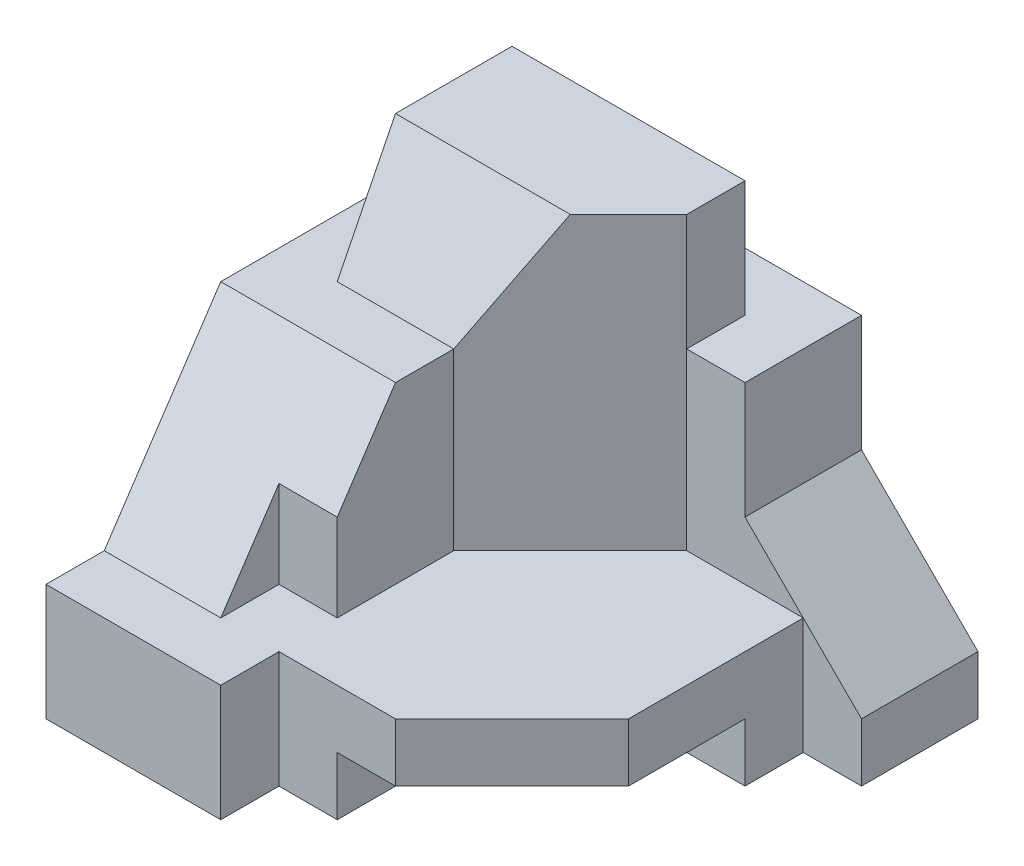
ISO-10303-21;
HEADER;
FILE_DESCRIPTION(('STEP AP214'),'2;1');
FILE_NAME('part.step','',(''),(''),'','','');
FILE_SCHEMA(('AUTOMOTIVE_DESIGN { 1 0 10303 214 1 1 1 1 }'));
ENDSEC;
DATA;
#1=APPLICATION_CONTEXT('core data for automotive mechanical design processes');
#2=APPLICATION_PROTOCOL_DEFINITION('international standard','automotive_design',2000,#1);
#3=PRODUCT_CONTEXT('',#1,'mechanical');
#4=PRODUCT('Part','Part','',(#3));
#5=PRODUCT_RELATED_PRODUCT_CATEGORY('part','',(#4));
#6=PRODUCT_DEFINITION_FORMATION('','',#4);
#7=PRODUCT_DEFINITION_CONTEXT('part definition',#1,'design');
#8=PRODUCT_DEFINITION('design','',#6,#7);
#9=PRODUCT_DEFINITION_SHAPE('','',#8);
#10=(LENGTH_UNIT() NAMED_UNIT(*) SI_UNIT(.MILLI.,.METRE.));
#11=(NAMED_UNIT(*) PLANE_ANGLE_UNIT() SI_UNIT($,.RADIAN.));
#12=(NAMED_UNIT(*) SI_UNIT($,.STERADIAN.) SOLID_ANGLE_UNIT());
#13=UNCERTAINTY_MEASURE_WITH_UNIT(LENGTH_MEASURE(1.E-05),#10,'distance_accuracy_value','');
#14=(GEOMETRIC_REPRESENTATION_CONTEXT(3) GLOBAL_UNCERTAINTY_ASSIGNED_CONTEXT((#13)) GLOBAL_UNIT_ASSIGNED_CONTEXT((#10,
#11,#12)) REPRESENTATION_CONTEXT('',''));
#15=CARTESIAN_POINT('',(0.,0.,0.));
#16=DIRECTION('',(0.,0.,1.));
#17=DIRECTION('',(1.,0.,0.));
#18=AXIS2_PLACEMENT_3D('',#15,#16,#17);
#19=CARTESIAN_POINT('',(-4.,-3.5,8.));
#20=DIRECTION('',(1.,0.,0.));
#21=DIRECTION('',(0.,0.,-1.));
#22=AXIS2_PLACEMENT_3D('',#19,#20,#21);
#23=PLANE('',#22);
#24=DIRECTION('',(0.,0.,1.));
#25=VECTOR('',#24,1.);
#26=CARTESIAN_POINT('',(-4.,1.5,8.));
#27=LINE('',#26,#25);
#28=CARTESIAN_POINT('',(-4.,1.5,0.));
#29=VERTEX_POINT('',#28);
#30=CARTESIAN_POINT('',(-4.,1.5,5.));
#31=VERTEX_POINT('',#30);
#32=EDGE_CURVE('E312',#29,#31,#27,.T.);
#33=ORIENTED_EDGE('',*,*,#32,.F.);
#34=DIRECTION('',(0.,-1.,0.));
#35=VECTOR('',#34,1.);
#36=CARTESIAN_POINT('',(-4.,-3.5,0.));
#37=LINE('',#36,#35);
#38=CARTESIAN_POINT('',(-4.,-3.5,0.));
#39=VERTEX_POINT('',#38);
#40=EDGE_CURVE('E255',#29,#39,#37,.T.);
#41=ORIENTED_EDGE('',*,*,#40,.T.);
#42=DIRECTION('',(0.,0.,-1.));
#43=VECTOR('',#42,1.);
#44=CARTESIAN_POINT('',(-4.,-3.5,8.));
#45=LINE('',#44,#43);
#46=CARTESIAN_POINT('',(-4.,-3.5,8.));
#47=VERTEX_POINT('',#46);
#48=EDGE_CURVE('E264',#47,#39,#45,.T.);
#49=ORIENTED_EDGE('',*,*,#48,.F.);
#50=DIRECTION('',(0.,-1.,0.));
#51=VECTOR('',#50,1.);
#52=CARTESIAN_POINT('',(-4.,-3.5,8.));
#53=LINE('',#52,#51);
#54=CARTESIAN_POINT('',(-4.,-1.5,8.));
#55=VERTEX_POINT('',#54);
#56=EDGE_CURVE('E248',#55,#47,#53,.T.);
#57=ORIENTED_EDGE('',*,*,#56,.F.);
#58=DIRECTION('',(0.,0.,1.));
#59=VECTOR('',#58,1.);
#60=CARTESIAN_POINT('',(-4.,-1.5,8.));
#61=LINE('',#60,#59);
#62=CARTESIAN_POINT('',(-4.,-1.5,7.));
#63=VERTEX_POINT('',#62);
#64=EDGE_CURVE('E322',#63,#55,#61,.T.);
#65=ORIENTED_EDGE('',*,*,#64,.F.);
#66=DIRECTION('',(0.,-0.832050294337844,0.554700196225229));
#67=VECTOR('',#66,1.);
#68=CARTESIAN_POINT('',(-4.,-1.5,7.));
#69=LINE('',#68,#67);
#70=EDGE_CURVE('E320',#31,#63,#69,.T.);
#71=ORIENTED_EDGE('',*,*,#70,.F.);
#72=EDGE_LOOP('',(#33,#41,#49,#57,#65,#71));
#73=FACE_BOUND('',#72,.T.);
#74=ADVANCED_FACE('F34',(#73),#23,.F.);
#75=CARTESIAN_POINT('',(0.,0.,0.));
#76=DIRECTION('',(0.,0.,1.));
#77=DIRECTION('',(1.,0.,0.));
#78=AXIS2_PLACEMENT_3D('',#75,#76,#77);
#79=PLANE('',#78);
#80=DIRECTION('',(-1.,0.,0.));
#81=VECTOR('',#80,1.);
#82=CARTESIAN_POINT('',(0.,1.5,0.));
#83=LINE('',#82,#81);
#84=CARTESIAN_POINT('',(2.,1.5,0.));
#85=VERTEX_POINT('',#84);
#86=EDGE_CURVE('E316',#85,#29,#83,.T.);
#87=ORIENTED_EDGE('',*,*,#86,.F.);
#88=DIRECTION('',(0.,1.,0.));
#89=VECTOR('',#88,1.);
#90=CARTESIAN_POINT('',(2.,-0.5,0.));
#91=LINE('',#90,#89);
#92=CARTESIAN_POINT('',(2.,-0.5,0.));
#93=VERTEX_POINT('',#92);
#94=EDGE_CURVE('E335',#93,#85,#91,.T.);
#95=ORIENTED_EDGE('',*,*,#94,.F.);
#96=DIRECTION('',(-0.707106781186548,0.707106781186548,0.));
#97=VECTOR('',#96,1.);
#98=CARTESIAN_POINT('',(2.,-0.5,0.));
#99=LINE('',#98,#97);
#100=CARTESIAN_POINT('',(4.,-2.5,0.));
#101=VERTEX_POINT('',#100);
#102=EDGE_CURVE('E334',#101,#93,#99,.T.);
#103=ORIENTED_EDGE('',*,*,#102,.F.);
#104=DIRECTION('',(0.,1.,0.));
#105=VECTOR('',#104,1.);
#106=CARTESIAN_POINT('',(4.,-3.5,0.));
#107=LINE('',#106,#105);
#108=CARTESIAN_POINT('',(4.,-3.5,0.));
#109=VERTEX_POINT('',#108);
#110=EDGE_CURVE('E251',#109,#101,#107,.T.);
#111=ORIENTED_EDGE('',*,*,#110,.F.);
#112=DIRECTION('',(1.,0.,0.));
#113=VECTOR('',#112,1.);
#114=CARTESIAN_POINT('',(4.,-3.5,0.));
#115=LINE('',#114,#113);
#116=EDGE_CURVE('E257',#39,#109,#115,.T.);
#117=ORIENTED_EDGE('',*,*,#116,.F.);
#118=ORIENTED_EDGE('',*,*,#40,.F.);
#119=EDGE_LOOP('',(#87,#95,#103,#111,#117,#118));
#120=FACE_BOUND('',#119,.T.);
#121=ADVANCED_FACE('F440',(#120),#79,.F.);
#122=CARTESIAN_POINT('',(3.,-3.5,2.));
#123=DIRECTION('',(-1.,0.,0.));
#124=DIRECTION('',(0.,0.,1.));
#125=AXIS2_PLACEMENT_3D('',#122,#123,#124);
#126=PLANE('',#125);
#127=DIRECTION('',(0.,1.,0.));
#128=VECTOR('',#127,1.);
#129=CARTESIAN_POINT('',(3.,-3.5,2.));
#130=LINE('',#129,#128);
#131=CARTESIAN_POINT('',(3.,-3.5,2.));
#132=VERTEX_POINT('',#131);
#133=CARTESIAN_POINT('',(3.,-1.5,2.));
#134=VERTEX_POINT('',#133);
#135=EDGE_CURVE('E230',#132,#134,#130,.T.);
#136=ORIENTED_EDGE('',*,*,#135,.T.);
#137=DIRECTION('',(0.,0.,-1.));
#138=VECTOR('',#137,1.);
#139=CARTESIAN_POINT('',(3.,-1.5,4.));
#140=LINE('',#139,#138);
#141=CARTESIAN_POINT('',(3.,-1.5,5.));
#142=VERTEX_POINT('',#141);
#143=EDGE_CURVE('E193',#142,#134,#140,.T.);
#144=ORIENTED_EDGE('',*,*,#143,.F.);
#145=DIRECTION('',(0.,1.,0.));
#146=VECTOR('',#145,1.);
#147=CARTESIAN_POINT('',(3.,-3.5,5.));
#148=LINE('',#147,#146);
#149=CARTESIAN_POINT('',(3.,-2.5,5.));
#150=VERTEX_POINT('',#149);
#151=EDGE_CURVE('E240',#150,#142,#148,.T.);
#152=ORIENTED_EDGE('',*,*,#151,.F.);
#153=DIRECTION('',(0.,0.,1.));
#154=VECTOR('',#153,1.);
#155=CARTESIAN_POINT('',(3.,-2.5,5.));
#156=LINE('',#155,#154);
#157=CARTESIAN_POINT('',(3.,-2.5,3.));
#158=VERTEX_POINT('',#157);
#159=EDGE_CURVE('E352',#158,#150,#156,.T.);
#160=ORIENTED_EDGE('',*,*,#159,.F.);
#161=DIRECTION('',(0.,-1.,0.));
#162=VECTOR('',#161,1.);
#163=CARTESIAN_POINT('',(3.,-2.5,3.));
#164=LINE('',#163,#162);
#165=CARTESIAN_POINT('',(3.,-3.5,3.));
#166=VERTEX_POINT('',#165);
#167=EDGE_CURVE('E360',#158,#166,#164,.T.);
#168=ORIENTED_EDGE('',*,*,#167,.T.);
#169=DIRECTION('',(0.,0.,1.));
#170=VECTOR('',#169,1.);
#171=CARTESIAN_POINT('',(3.,-3.5,2.));
#172=LINE('',#171,#170);
#173=EDGE_CURVE('E238',#132,#166,#172,.T.);
#174=ORIENTED_EDGE('',*,*,#173,.F.);
#175=EDGE_LOOP('',(#136,#144,#152,#160,#168,#174));
#176=FACE_BOUND('',#175,.T.);
#177=ADVANCED_FACE('F235',(#176),#126,.F.);
#178=CARTESIAN_POINT('',(2.,-0.5,2.));
#179=DIRECTION('',(-1.,0.,0.));
#180=DIRECTION('',(0.,0.,1.));
#181=AXIS2_PLACEMENT_3D('',#178,#179,#180);
#182=PLANE('',#181);
#183=DIRECTION('',(0.,0.,-1.));
#184=VECTOR('',#183,1.);
#185=CARTESIAN_POINT('',(2.,1.5,2.));
#186=LINE('',#185,#184);
#187=CARTESIAN_POINT('',(2.,1.5,2.));
#188=VERTEX_POINT('',#187);
#189=EDGE_CURVE('E318',#188,#85,#186,.T.);
#190=ORIENTED_EDGE('',*,*,#189,.F.);
#191=DIRECTION('',(0.,1.,0.));
#192=VECTOR('',#191,1.);
#193=CARTESIAN_POINT('',(2.,1.5,2.));
#194=LINE('',#193,#192);
#195=CARTESIAN_POINT('',(2.,-0.5,2.));
#196=VERTEX_POINT('',#195);
#197=EDGE_CURVE('E225',#196,#188,#194,.T.);
#198=ORIENTED_EDGE('',*,*,#197,.F.);
#199=DIRECTION('',(0.,0.,-1.));
#200=VECTOR('',#199,1.);
#201=CARTESIAN_POINT('',(2.,-0.5,2.));
#202=LINE('',#201,#200);
#203=EDGE_CURVE('E224',#196,#93,#202,.T.);
#204=ORIENTED_EDGE('',*,*,#203,.T.);
#205=ORIENTED_EDGE('',*,*,#94,.T.);
#206=EDGE_LOOP('',(#190,#198,#204,#205));
#207=FACE_BOUND('',#206,.T.);
#208=ADVANCED_FACE('F444',(#207),#182,.F.);
#209=CARTESIAN_POINT('',(4.,-3.5,8.));
#210=DIRECTION('',(0.,1.,0.));
#211=DIRECTION('',(-1.,0.,0.));
#212=AXIS2_PLACEMENT_3D('',#209,#210,#211);
#213=PLANE('',#212);
#214=ORIENTED_EDGE('',*,*,#173,.T.);
#215=DIRECTION('',(1.,0.,0.));
#216=VECTOR('',#215,1.);
#217=CARTESIAN_POINT('',(3.,-3.5,3.));
#218=LINE('',#217,#216);
#219=CARTESIAN_POINT('',(0.,-3.5,3.));
#220=VERTEX_POINT('',#219);
#221=EDGE_CURVE('E347',#220,#166,#218,.T.);
#222=ORIENTED_EDGE('',*,*,#221,.F.);
#223=DIRECTION('',(0.,0.,-1.));
#224=VECTOR('',#223,1.);
#225=CARTESIAN_POINT('',(0.,-3.5,3.));
#226=LINE('',#225,#224);
#227=CARTESIAN_POINT('',(0.,-3.5,7.));
#228=VERTEX_POINT('',#227);
#229=EDGE_CURVE('E341',#228,#220,#226,.T.);
#230=ORIENTED_EDGE('',*,*,#229,.F.);
#231=DIRECTION('',(-1.,0.,0.));
#232=VECTOR('',#231,1.);
#233=CARTESIAN_POINT('',(1.,-3.5,7.));
#234=LINE('',#233,#232);
#235=CARTESIAN_POINT('',(-1.,-3.5,7.));
#236=VERTEX_POINT('',#235);
#237=EDGE_CURVE('E368',#228,#236,#234,.T.);
#238=ORIENTED_EDGE('',*,*,#237,.T.);
#239=DIRECTION('',(0.,0.,1.));
#240=VECTOR('',#239,1.);
#241=CARTESIAN_POINT('',(-1.,-3.5,7.));
#242=LINE('',#241,#240);
#243=CARTESIAN_POINT('',(-1.,-3.5,8.));
#244=VERTEX_POINT('',#243);
#245=EDGE_CURVE('E244',#236,#244,#242,.T.);
#246=ORIENTED_EDGE('',*,*,#245,.T.);
#247=DIRECTION('',(1.,0.,0.));
#248=VECTOR('',#247,1.);
#249=CARTESIAN_POINT('',(4.,-3.5,8.));
#250=LINE('',#249,#248);
#251=EDGE_CURVE('E250',#47,#244,#250,.T.);
#252=ORIENTED_EDGE('',*,*,#251,.F.);
#253=ORIENTED_EDGE('',*,*,#48,.T.);
#254=ORIENTED_EDGE('',*,*,#116,.T.);
#255=DIRECTION('',(0.,0.,-1.));
#256=VECTOR('',#255,1.);
#257=CARTESIAN_POINT('',(4.,-3.5,8.));
#258=LINE('',#257,#256);
#259=CARTESIAN_POINT('',(4.,-3.5,2.));
#260=VERTEX_POINT('',#259);
#261=EDGE_CURVE('E254',#260,#109,#258,.T.);
#262=ORIENTED_EDGE('',*,*,#261,.F.);
#263=DIRECTION('',(-1.,0.,0.));
#264=VECTOR('',#263,1.);
#265=CARTESIAN_POINT('',(4.,-3.5,2.));
#266=LINE('',#265,#264);
#267=EDGE_CURVE('E362',#260,#132,#266,.T.);
#268=ORIENTED_EDGE('',*,*,#267,.T.);
#269=EDGE_LOOP('',(#214,#222,#230,#238,#246,#252,#253,#254,#262,#268));
#270=FACE_BOUND('',#269,.T.);
#271=ADVANCED_FACE('F421',(#270),#213,.F.);
#272=CARTESIAN_POINT('',(4.,-3.5,8.));
#273=DIRECTION('',(-1.,0.,0.));
#274=DIRECTION('',(0.,0.,1.));
#275=AXIS2_PLACEMENT_3D('',#272,#273,#274);
#276=PLANE('',#275);
#277=ORIENTED_EDGE('',*,*,#110,.T.);
#278=DIRECTION('',(0.,0.,-1.));
#279=VECTOR('',#278,1.);
#280=CARTESIAN_POINT('',(4.,-2.5,2.));
#281=LINE('',#280,#279);
#282=CARTESIAN_POINT('',(4.,-2.5,2.));
#283=VERTEX_POINT('',#282);
#284=EDGE_CURVE('E234',#283,#101,#281,.T.);
#285=ORIENTED_EDGE('',*,*,#284,.F.);
#286=DIRECTION('',(0.,1.,0.));
#287=VECTOR('',#286,1.);
#288=CARTESIAN_POINT('',(4.,-3.5,2.));
#289=LINE('',#288,#287);
#290=EDGE_CURVE('E233',#260,#283,#289,.T.);
#291=ORIENTED_EDGE('',*,*,#290,.F.);
#292=ORIENTED_EDGE('',*,*,#261,.T.);
#293=EDGE_LOOP('',(#277,#285,#291,#292));
#294=FACE_BOUND('',#293,.T.);
#295=ADVANCED_FACE('F435',(#294),#276,.F.);
#296=CARTESIAN_POINT('',(0.,0.,8.));
#297=DIRECTION('',(0.,0.,1.));
#298=DIRECTION('',(1.,0.,0.));
#299=AXIS2_PLACEMENT_3D('',#296,#297,#298);
#300=PLANE('',#299);
#301=DIRECTION('',(-1.,0.,0.));
#302=VECTOR('',#301,1.);
#303=CARTESIAN_POINT('',(4.,-1.5,8.));
#304=LINE('',#303,#302);
#305=CARTESIAN_POINT('',(-1.,-1.5,8.));
#306=VERTEX_POINT('',#305);
#307=EDGE_CURVE('E325',#306,#55,#304,.T.);
#308=ORIENTED_EDGE('',*,*,#307,.T.);
#309=ORIENTED_EDGE('',*,*,#56,.T.);
#310=ORIENTED_EDGE('',*,*,#251,.T.);
#311=DIRECTION('',(0.,1.,0.));
#312=VECTOR('',#311,1.);
#313=CARTESIAN_POINT('',(-1.,-3.5,8.));
#314=LINE('',#313,#312);
#315=EDGE_CURVE('E258',#244,#306,#314,.T.);
#316=ORIENTED_EDGE('',*,*,#315,.T.);
#317=EDGE_LOOP('',(#308,#309,#310,#316));
#318=FACE_BOUND('',#317,.T.);
#319=ADVANCED_FACE('F415',(#318),#300,.T.);
#320=CARTESIAN_POINT('',(-1.,-3.5,7.));
#321=DIRECTION('',(-1.,0.,0.));
#322=DIRECTION('',(0.,0.,1.));
#323=AXIS2_PLACEMENT_3D('',#320,#321,#322);
#324=PLANE('',#323);
#325=DIRECTION('',(0.,1.,0.));
#326=VECTOR('',#325,1.);
#327=CARTESIAN_POINT('',(-1.,-3.5,7.));
#328=LINE('',#327,#326);
#329=CARTESIAN_POINT('',(-1.,-1.5,7.));
#330=VERTEX_POINT('',#329);
#331=EDGE_CURVE('E374',#236,#330,#328,.T.);
#332=ORIENTED_EDGE('',*,*,#331,.T.);
#333=DIRECTION('',(0.,0.,1.));
#334=VECTOR('',#333,1.);
#335=CARTESIAN_POINT('',(-1.,-1.5,7.));
#336=LINE('',#335,#334);
#337=EDGE_CURVE('E328',#330,#306,#336,.T.);
#338=ORIENTED_EDGE('',*,*,#337,.T.);
#339=ORIENTED_EDGE('',*,*,#315,.F.);
#340=ORIENTED_EDGE('',*,*,#245,.F.);
#341=EDGE_LOOP('',(#332,#338,#339,#340));
#342=FACE_BOUND('',#341,.T.);
#343=ADVANCED_FACE('F419',(#342),#324,.F.);
#344=CARTESIAN_POINT('',(1.,-3.5,7.));
#345=DIRECTION('',(0.,0.,-1.));
#346=DIRECTION('',(-1.,0.,0.));
#347=AXIS2_PLACEMENT_3D('',#344,#345,#346);
#348=PLANE('',#347);
#349=DIRECTION('',(0.,1.,0.));
#350=VECTOR('',#349,1.);
#351=CARTESIAN_POINT('',(1.,-3.5,7.));
#352=LINE('',#351,#350);
#353=CARTESIAN_POINT('',(1.,-2.5,7.));
#354=VERTEX_POINT('',#353);
#355=CARTESIAN_POINT('',(1.,-1.5,7.));
#356=VERTEX_POINT('',#355);
#357=EDGE_CURVE('E242',#354,#356,#352,.T.);
#358=ORIENTED_EDGE('',*,*,#357,.T.);
#359=DIRECTION('',(-1.,0.,0.));
#360=VECTOR('',#359,1.);
#361=CARTESIAN_POINT('',(4.,-1.5,7.));
#362=LINE('',#361,#360);
#363=EDGE_CURVE('E329',#356,#330,#362,.T.);
#364=ORIENTED_EDGE('',*,*,#363,.T.);
#365=ORIENTED_EDGE('',*,*,#331,.F.);
#366=ORIENTED_EDGE('',*,*,#237,.F.);
#367=DIRECTION('',(0.,-1.,0.));
#368=VECTOR('',#367,1.);
#369=CARTESIAN_POINT('',(0.,-2.5,7.));
#370=LINE('',#369,#368);
#371=CARTESIAN_POINT('',(0.,-2.5,7.));
#372=VERTEX_POINT('',#371);
#373=EDGE_CURVE('E356',#372,#228,#370,.T.);
#374=ORIENTED_EDGE('',*,*,#373,.F.);
#375=DIRECTION('',(-1.,0.,0.));
#376=VECTOR('',#375,1.);
#377=CARTESIAN_POINT('',(0.,-2.5,7.));
#378=LINE('',#377,#376);
#379=EDGE_CURVE('E343',#354,#372,#378,.T.);
#380=ORIENTED_EDGE('',*,*,#379,.F.);
#381=EDGE_LOOP('',(#358,#364,#365,#366,#374,#380));
#382=FACE_BOUND('',#381,.T.);
#383=ADVANCED_FACE('F381',(#382),#348,.F.);
#384=CARTESIAN_POINT('',(3.,-3.5,5.));
#385=DIRECTION('',(-0.707106781186547,0.,-0.707106781186548));
#386=DIRECTION('',(-0.707106781186548,0.,0.707106781186547));
#387=AXIS2_PLACEMENT_3D('',#384,#385,#386);
#388=PLANE('',#387);
#389=ORIENTED_EDGE('',*,*,#151,.T.);
#390=DIRECTION('',(-0.707106781186548,0.,0.707106781186547));
#391=VECTOR('',#390,1.);
#392=CARTESIAN_POINT('',(3.,-1.5,5.));
#393=LINE('',#392,#391);
#394=EDGE_CURVE('E200',#142,#356,#393,.T.);
#395=ORIENTED_EDGE('',*,*,#394,.T.);
#396=ORIENTED_EDGE('',*,*,#357,.F.);
#397=DIRECTION('',(-0.707106781186548,0.,0.707106781186547));
#398=VECTOR('',#397,1.);
#399=CARTESIAN_POINT('',(1.,-2.5,7.));
#400=LINE('',#399,#398);
#401=EDGE_CURVE('E354',#150,#354,#400,.T.);
#402=ORIENTED_EDGE('',*,*,#401,.F.);
#403=EDGE_LOOP('',(#389,#395,#396,#402));
#404=FACE_BOUND('',#403,.T.);
#405=ADVANCED_FACE('F386',(#404),#388,.F.);
#406=CARTESIAN_POINT('',(4.,-3.5,2.));
#407=DIRECTION('',(0.,0.,-1.));
#408=DIRECTION('',(-1.,0.,0.));
#409=AXIS2_PLACEMENT_3D('',#406,#407,#408);
#410=PLANE('',#409);
#411=ORIENTED_EDGE('',*,*,#290,.T.);
#412=DIRECTION('',(-0.707106781186548,0.707106781186548,0.));
#413=VECTOR('',#412,1.);
#414=CARTESIAN_POINT('',(2.,-0.5,2.));
#415=LINE('',#414,#413);
#416=EDGE_CURVE('E222',#283,#134,#415,.T.);
#417=ORIENTED_EDGE('',*,*,#416,.T.);
#418=ORIENTED_EDGE('',*,*,#135,.F.);
#419=ORIENTED_EDGE('',*,*,#267,.F.);
#420=EDGE_LOOP('',(#411,#417,#418,#419));
#421=FACE_BOUND('',#420,.T.);
#422=ADVANCED_FACE('F229',(#421),#410,.F.);
#423=CARTESIAN_POINT('',(3.,-2.5,3.));
#424=DIRECTION('',(0.,0.,-1.));
#425=DIRECTION('',(-1.,0.,0.));
#426=AXIS2_PLACEMENT_3D('',#423,#424,#425);
#427=PLANE('',#426);
#428=ORIENTED_EDGE('',*,*,#221,.T.);
#429=ORIENTED_EDGE('',*,*,#167,.F.);
#430=DIRECTION('',(1.,0.,0.));
#431=VECTOR('',#430,1.);
#432=CARTESIAN_POINT('',(3.,-2.5,3.));
#433=LINE('',#432,#431);
#434=CARTESIAN_POINT('',(0.,-2.5,3.));
#435=VERTEX_POINT('',#434);
#436=EDGE_CURVE('E350',#435,#158,#433,.T.);
#437=ORIENTED_EDGE('',*,*,#436,.F.);
#438=DIRECTION('',(0.,-1.,0.));
#439=VECTOR('',#438,1.);
#440=CARTESIAN_POINT('',(0.,-2.5,3.));
#441=LINE('',#440,#439);
#442=EDGE_CURVE('E363',#435,#220,#441,.T.);
#443=ORIENTED_EDGE('',*,*,#442,.T.);
#444=EDGE_LOOP('',(#428,#429,#437,#443));
#445=FACE_BOUND('',#444,.T.);
#446=ADVANCED_FACE('F515',(#445),#427,.F.);
#447=CARTESIAN_POINT('',(0.,-2.5,3.));
#448=DIRECTION('',(-1.,0.,0.));
#449=DIRECTION('',(0.,-1.,0.));
#450=AXIS2_PLACEMENT_3D('',#447,#448,#449);
#451=PLANE('',#450);
#452=ORIENTED_EDGE('',*,*,#229,.T.);
#453=ORIENTED_EDGE('',*,*,#442,.F.);
#454=DIRECTION('',(0.,0.,-1.));
#455=VECTOR('',#454,1.);
#456=CARTESIAN_POINT('',(0.,-2.5,3.));
#457=LINE('',#456,#455);
#458=EDGE_CURVE('E346',#372,#435,#457,.T.);
#459=ORIENTED_EDGE('',*,*,#458,.F.);
#460=ORIENTED_EDGE('',*,*,#373,.T.);
#461=EDGE_LOOP('',(#452,#453,#459,#460));
#462=FACE_BOUND('',#461,.T.);
#463=ADVANCED_FACE('F426',(#462),#451,.F.);
#464=CARTESIAN_POINT('',(0.,-2.5,0.));
#465=DIRECTION('',(0.,1.,0.));
#466=DIRECTION('',(0.,0.,1.));
#467=AXIS2_PLACEMENT_3D('',#464,#465,#466);
#468=PLANE('',#467);
#469=ORIENTED_EDGE('',*,*,#379,.T.);
#470=ORIENTED_EDGE('',*,*,#458,.T.);
#471=ORIENTED_EDGE('',*,*,#436,.T.);
#472=ORIENTED_EDGE('',*,*,#159,.T.);
#473=ORIENTED_EDGE('',*,*,#401,.T.);
#474=EDGE_LOOP('',(#469,#470,#471,#472,#473));
#475=FACE_BOUND('',#474,.T.);
#476=ADVANCED_FACE('F429',(#475),#468,.F.);
#477=CARTESIAN_POINT('',(2.,-0.5,2.));
#478=DIRECTION('',(-0.707106781186547,-0.707106781186547,0.));
#479=DIRECTION('',(0.707106781186548,-0.707106781186548,0.));
#480=AXIS2_PLACEMENT_3D('',#477,#478,#479);
#481=PLANE('',#480);
#482=ORIENTED_EDGE('',*,*,#102,.T.);
#483=ORIENTED_EDGE('',*,*,#203,.F.);
#484=EDGE_CURVE('E211',#134,#196,#415,.T.);
#485=ORIENTED_EDGE('',*,*,#484,.F.);
#486=ORIENTED_EDGE('',*,*,#416,.F.);
#487=ORIENTED_EDGE('',*,*,#284,.T.);
#488=EDGE_LOOP('',(#482,#483,#485,#486,#487));
#489=FACE_BOUND('',#488,.T.);
#490=ADVANCED_FACE('F221',(#489),#481,.F.);
#491=CARTESIAN_POINT('',(4.,-1.5,8.));
#492=DIRECTION('',(0.,-1.,0.));
#493=DIRECTION('',(0.,0.,-1.));
#494=AXIS2_PLACEMENT_3D('',#491,#492,#493);
#495=PLANE('',#494);
#496=ORIENTED_EDGE('',*,*,#337,.F.);
#497=ORIENTED_EDGE('',*,*,#363,.F.);
#498=ORIENTED_EDGE('',*,*,#394,.F.);
#499=ORIENTED_EDGE('',*,*,#143,.T.);
#500=DIRECTION('',(-1.,0.,0.));
#501=VECTOR('',#500,1.);
#502=CARTESIAN_POINT('',(1.,-1.5,2.));
#503=LINE('',#502,#501);
#504=CARTESIAN_POINT('',(1.,-1.5,2.));
#505=VERTEX_POINT('',#504);
#506=EDGE_CURVE('E197',#134,#505,#503,.T.);
#507=ORIENTED_EDGE('',*,*,#506,.T.);
#508=DIRECTION('',(-0.707106781186548,0.,0.707106781186547));
#509=VECTOR('',#508,1.);
#510=CARTESIAN_POINT('',(1.,-1.5,2.));
#511=LINE('',#510,#509);
#512=CARTESIAN_POINT('',(-1.,-1.5,4.));
#513=VERTEX_POINT('',#512);
#514=EDGE_CURVE('E449',#505,#513,#511,.T.);
#515=ORIENTED_EDGE('',*,*,#514,.T.);
#516=DIRECTION('',(0.,0.,1.));
#517=VECTOR('',#516,1.);
#518=CARTESIAN_POINT('',(-1.,-1.5,7.));
#519=LINE('',#518,#517);
#520=CARTESIAN_POINT('',(-1.,-1.5,6.));
#521=VERTEX_POINT('',#520);
#522=EDGE_CURVE('E206',#513,#521,#519,.T.);
#523=ORIENTED_EDGE('',*,*,#522,.T.);
#524=DIRECTION('',(-1.,0.,0.));
#525=VECTOR('',#524,1.);
#526=CARTESIAN_POINT('',(-1.,-1.5,6.));
#527=LINE('',#526,#525);
#528=CARTESIAN_POINT('',(-2.,-1.5,6.));
#529=VERTEX_POINT('',#528);
#530=EDGE_CURVE('E394',#521,#529,#527,.T.);
#531=ORIENTED_EDGE('',*,*,#530,.T.);
#532=DIRECTION('',(0.,0.,1.));
#533=VECTOR('',#532,1.);
#534=CARTESIAN_POINT('',(-2.,-1.5,6.));
#535=LINE('',#534,#533);
#536=CARTESIAN_POINT('',(-2.,-1.5,7.));
#537=VERTEX_POINT('',#536);
#538=EDGE_CURVE('E55',#529,#537,#535,.T.);
#539=ORIENTED_EDGE('',*,*,#538,.T.);
#540=EDGE_CURVE('E275',#537,#63,#362,.T.);
#541=ORIENTED_EDGE('',*,*,#540,.T.);
#542=ORIENTED_EDGE('',*,*,#64,.T.);
#543=ORIENTED_EDGE('',*,*,#307,.F.);
#544=EDGE_LOOP('',(#496,#497,#498,#499,#507,#515,#523,#531,#539,#541,#542,#543));
#545=FACE_BOUND('',#544,.T.);
#546=ADVANCED_FACE('F195',(#545),#495,.F.);
#547=CARTESIAN_POINT('',(4.,-1.5,7.));
#548=DIRECTION('',(0.,-0.554700196225229,-0.832050294337844));
#549=DIRECTION('',(0.,0.832050294337844,-0.554700196225229));
#550=AXIS2_PLACEMENT_3D('',#547,#548,#549);
#551=PLANE('',#550);
#552=DIRECTION('',(1.,0.,0.));
#553=VECTOR('',#552,1.);
#554=CARTESIAN_POINT('',(4.,0.,5.99999999999999));
#555=LINE('',#554,#553);
#556=CARTESIAN_POINT('',(-2.,0.,6.));
#557=VERTEX_POINT('',#556);
#558=CARTESIAN_POINT('',(-1.,0.,6.));
#559=VERTEX_POINT('',#558);
#560=EDGE_CURVE('E267',#557,#559,#555,.T.);
#561=ORIENTED_EDGE('',*,*,#560,.T.);
#562=DIRECTION('',(0.,0.832050294337844,-0.554700196225229));
#563=VECTOR('',#562,1.);
#564=CARTESIAN_POINT('',(-1.,-1.5,7.));
#565=LINE('',#564,#563);
#566=CARTESIAN_POINT('',(-1.,1.5,5.));
#567=VERTEX_POINT('',#566);
#568=EDGE_CURVE('E387',#559,#567,#565,.T.);
#569=ORIENTED_EDGE('',*,*,#568,.T.);
#570=DIRECTION('',(-1.,0.,0.));
#571=VECTOR('',#570,1.);
#572=CARTESIAN_POINT('',(4.,1.5,5.));
#573=LINE('',#572,#571);
#574=EDGE_CURVE('E324',#567,#31,#573,.T.);
#575=ORIENTED_EDGE('',*,*,#574,.T.);
#576=ORIENTED_EDGE('',*,*,#70,.T.);
#577=ORIENTED_EDGE('',*,*,#540,.F.);
#578=DIRECTION('',(0.,0.832050294337844,-0.554700196225229));
#579=VECTOR('',#578,1.);
#580=CARTESIAN_POINT('',(-2.,-1.5,7.));
#581=LINE('',#580,#579);
#582=EDGE_CURVE('E41',#537,#557,#581,.T.);
#583=ORIENTED_EDGE('',*,*,#582,.T.);
#584=EDGE_LOOP('',(#561,#569,#575,#576,#577,#583));
#585=FACE_BOUND('',#584,.T.);
#586=ADVANCED_FACE('F272',(#585),#551,.F.);
#587=CARTESIAN_POINT('',(0.,1.5,4.));
#588=DIRECTION('',(0.,1.,0.));
#589=DIRECTION('',(-1.,0.,0.));
#590=AXIS2_PLACEMENT_3D('',#587,#588,#589);
#591=PLANE('',#590);
#592=DIRECTION('',(-1.,0.,0.));
#593=VECTOR('',#592,1.);
#594=CARTESIAN_POINT('',(1.,1.5,2.));
#595=LINE('',#594,#593);
#596=CARTESIAN_POINT('',(1.,1.5,2.));
#597=VERTEX_POINT('',#596);
#598=EDGE_CURVE('E215',#188,#597,#595,.T.);
#599=ORIENTED_EDGE('',*,*,#598,.F.);
#600=ORIENTED_EDGE('',*,*,#189,.T.);
#601=ORIENTED_EDGE('',*,*,#86,.T.);
#602=ORIENTED_EDGE('',*,*,#32,.T.);
#603=ORIENTED_EDGE('',*,*,#574,.F.);
#604=DIRECTION('',(0.,0.,1.));
#605=VECTOR('',#604,1.);
#606=CARTESIAN_POINT('',(-1.,1.5,4.));
#607=LINE('',#606,#605);
#608=CARTESIAN_POINT('',(-1.,1.5,4.));
#609=VERTEX_POINT('',#608);
#610=EDGE_CURVE('E389',#609,#567,#607,.T.);
#611=ORIENTED_EDGE('',*,*,#610,.F.);
#612=DIRECTION('',(1.,0.,0.));
#613=VECTOR('',#612,1.);
#614=CARTESIAN_POINT('',(-3.,1.5,4.));
#615=LINE('',#614,#613);
#616=CARTESIAN_POINT('',(-3.,1.5,4.));
#617=VERTEX_POINT('',#616);
#618=EDGE_CURVE('E300',#617,#609,#615,.T.);
#619=ORIENTED_EDGE('',*,*,#618,.F.);
#620=DIRECTION('',(0.,0.,1.));
#621=VECTOR('',#620,1.);
#622=CARTESIAN_POINT('',(-3.,1.5,1.));
#623=LINE('',#622,#621);
#624=CARTESIAN_POINT('',(-3.,1.5,1.));
#625=VERTEX_POINT('',#624);
#626=EDGE_CURVE('E296',#625,#617,#623,.T.);
#627=ORIENTED_EDGE('',*,*,#626,.F.);
#628=DIRECTION('',(-1.,0.,0.));
#629=VECTOR('',#628,1.);
#630=CARTESIAN_POINT('',(1.,1.5,1.));
#631=LINE('',#630,#629);
#632=CARTESIAN_POINT('',(1.,1.5,1.));
#633=VERTEX_POINT('',#632);
#634=EDGE_CURVE('E293',#633,#625,#631,.T.);
#635=ORIENTED_EDGE('',*,*,#634,.F.);
#636=DIRECTION('',(0.,0.,-1.));
#637=VECTOR('',#636,1.);
#638=CARTESIAN_POINT('',(1.,1.5,4.));
#639=LINE('',#638,#637);
#640=EDGE_CURVE('E303',#597,#633,#639,.T.);
#641=ORIENTED_EDGE('',*,*,#640,.F.);
#642=EDGE_LOOP('',(#599,#600,#601,#602,#603,#611,#619,#627,#635,#641));
#643=FACE_BOUND('',#642,.T.);
#644=ADVANCED_FACE('F404',(#643),#591,.T.);
#645=CARTESIAN_POINT('',(1.,1.5,1.));
#646=DIRECTION('',(0.,0.,-1.));
#647=DIRECTION('',(-1.,0.,0.));
#648=AXIS2_PLACEMENT_3D('',#645,#646,#647);
#649=PLANE('',#648);
#650=DIRECTION('',(-1.,0.,0.));
#651=VECTOR('',#650,1.);
#652=CARTESIAN_POINT('',(1.,3.5,1.));
#653=LINE('',#652,#651);
#654=CARTESIAN_POINT('',(1.,3.5,1.));
#655=VERTEX_POINT('',#654);
#656=CARTESIAN_POINT('',(-3.,3.5,1.));
#657=VERTEX_POINT('',#656);
#658=EDGE_CURVE('E282',#655,#657,#653,.T.);
#659=ORIENTED_EDGE('',*,*,#658,.F.);
#660=DIRECTION('',(0.,1.,0.));
#661=VECTOR('',#660,1.);
#662=CARTESIAN_POINT('',(1.,1.5,1.));
#663=LINE('',#662,#661);
#664=EDGE_CURVE('E309',#633,#655,#663,.T.);
#665=ORIENTED_EDGE('',*,*,#664,.F.);
#666=ORIENTED_EDGE('',*,*,#634,.T.);
#667=DIRECTION('',(0.,1.,0.));
#668=VECTOR('',#667,1.);
#669=CARTESIAN_POINT('',(-3.,1.5,1.));
#670=LINE('',#669,#668);
#671=EDGE_CURVE('E304',#625,#657,#670,.T.);
#672=ORIENTED_EDGE('',*,*,#671,.T.);
#673=EDGE_LOOP('',(#659,#665,#666,#672));
#674=FACE_BOUND('',#673,.T.);
#675=ADVANCED_FACE('F472',(#674),#649,.T.);
#676=CARTESIAN_POINT('',(1.,1.5,4.));
#677=DIRECTION('',(1.,0.,0.));
#678=DIRECTION('',(0.,0.,-1.));
#679=AXIS2_PLACEMENT_3D('',#676,#677,#678);
#680=PLANE('',#679);
#681=DIRECTION('',(0.,1.,0.));
#682=VECTOR('',#681,1.);
#683=CARTESIAN_POINT('',(1.,-1.5,2.));
#684=LINE('',#683,#682);
#685=CARTESIAN_POINT('',(1.,3.5,2.));
#686=VERTEX_POINT('',#685);
#687=EDGE_CURVE('E451',#597,#686,#684,.T.);
#688=ORIENTED_EDGE('',*,*,#687,.F.);
#689=ORIENTED_EDGE('',*,*,#640,.T.);
#690=ORIENTED_EDGE('',*,*,#664,.T.);
#691=DIRECTION('',(0.,0.,-1.));
#692=VECTOR('',#691,1.);
#693=CARTESIAN_POINT('',(1.,3.5,4.));
#694=LINE('',#693,#692);
#695=EDGE_CURVE('E297',#686,#655,#694,.T.);
#696=ORIENTED_EDGE('',*,*,#695,.F.);
#697=EDGE_LOOP('',(#688,#689,#690,#696));
#698=FACE_BOUND('',#697,.T.);
#699=ADVANCED_FACE('F476',(#698),#680,.T.);
#700=CARTESIAN_POINT('',(-3.,1.5,1.));
#701=DIRECTION('',(-1.,0.,0.));
#702=DIRECTION('',(0.,-1.,0.));
#703=AXIS2_PLACEMENT_3D('',#700,#701,#702);
#704=PLANE('',#703);
#705=DIRECTION('',(0.,-0.894427190999916,0.447213595499958));
#706=VECTOR('',#705,1.);
#707=CARTESIAN_POINT('',(-3.,1.5,4.));
#708=LINE('',#707,#706);
#709=CARTESIAN_POINT('',(-3.,3.5,3.));
#710=VERTEX_POINT('',#709);
#711=EDGE_CURVE('E454',#710,#617,#708,.T.);
#712=ORIENTED_EDGE('',*,*,#711,.F.);
#713=DIRECTION('',(0.,0.,1.));
#714=VECTOR('',#713,1.);
#715=CARTESIAN_POINT('',(-3.,3.5,1.));
#716=LINE('',#715,#714);
#717=EDGE_CURVE('E286',#657,#710,#716,.T.);
#718=ORIENTED_EDGE('',*,*,#717,.F.);
#719=ORIENTED_EDGE('',*,*,#671,.F.);
#720=ORIENTED_EDGE('',*,*,#626,.T.);
#721=EDGE_LOOP('',(#712,#718,#719,#720));
#722=FACE_BOUND('',#721,.T.);
#723=ADVANCED_FACE('F465',(#722),#704,.T.);
#724=CARTESIAN_POINT('',(4.,3.5,8.));
#725=DIRECTION('',(0.,-1.,0.));
#726=DIRECTION('',(1.,0.,0.));
#727=AXIS2_PLACEMENT_3D('',#724,#725,#726);
#728=PLANE('',#727);
#729=DIRECTION('',(-1.,0.,0.));
#730=VECTOR('',#729,1.);
#731=CARTESIAN_POINT('',(-3.,3.5,3.));
#732=LINE('',#731,#730);
#733=CARTESIAN_POINT('',(0.,3.5,3.));
#734=VERTEX_POINT('',#733);
#735=EDGE_CURVE('E456',#734,#710,#732,.T.);
#736=ORIENTED_EDGE('',*,*,#735,.F.);
#737=DIRECTION('',(-0.707106781186548,0.,0.707106781186547));
#738=VECTOR('',#737,1.);
#739=CARTESIAN_POINT('',(1.,3.5,2.));
#740=LINE('',#739,#738);
#741=EDGE_CURVE('E48',#686,#734,#740,.T.);
#742=ORIENTED_EDGE('',*,*,#741,.F.);
#743=ORIENTED_EDGE('',*,*,#695,.T.);
#744=ORIENTED_EDGE('',*,*,#658,.T.);
#745=ORIENTED_EDGE('',*,*,#717,.T.);
#746=EDGE_LOOP('',(#736,#742,#743,#744,#745));
#747=FACE_BOUND('',#746,.T.);
#748=ADVANCED_FACE('F467',(#747),#728,.F.);
#749=CARTESIAN_POINT('',(-2.,-1.5,6.));
#750=DIRECTION('',(-1.,0.,0.));
#751=DIRECTION('',(0.,-1.,0.));
#752=AXIS2_PLACEMENT_3D('',#749,#750,#751);
#753=PLANE('',#752);
#754=ORIENTED_EDGE('',*,*,#538,.F.);
#755=DIRECTION('',(0.,1.,0.));
#756=VECTOR('',#755,1.);
#757=CARTESIAN_POINT('',(-2.,-1.5,6.));
#758=LINE('',#757,#756);
#759=EDGE_CURVE('E279',#529,#557,#758,.T.);
#760=ORIENTED_EDGE('',*,*,#759,.T.);
#761=ORIENTED_EDGE('',*,*,#582,.F.);
#762=EDGE_LOOP('',(#754,#760,#761));
#763=FACE_BOUND('',#762,.T.);
#764=ADVANCED_FACE('F278',(#763),#753,.F.);
#765=CARTESIAN_POINT('',(-1.,-1.5,6.));
#766=DIRECTION('',(0.,0.,-1.));
#767=DIRECTION('',(-1.,0.,0.));
#768=AXIS2_PLACEMENT_3D('',#765,#766,#767);
#769=PLANE('',#768);
#770=ORIENTED_EDGE('',*,*,#759,.F.);
#771=ORIENTED_EDGE('',*,*,#530,.F.);
#772=DIRECTION('',(0.,1.,0.));
#773=VECTOR('',#772,1.);
#774=CARTESIAN_POINT('',(-1.,-1.5,6.));
#775=LINE('',#774,#773);
#776=EDGE_CURVE('E283',#521,#559,#775,.T.);
#777=ORIENTED_EDGE('',*,*,#776,.T.);
#778=ORIENTED_EDGE('',*,*,#560,.F.);
#779=EDGE_LOOP('',(#770,#771,#777,#778));
#780=FACE_BOUND('',#779,.T.);
#781=ADVANCED_FACE('F397',(#780),#769,.F.);
#782=CARTESIAN_POINT('',(-1.,-1.5,6.));
#783=DIRECTION('',(-1.,0.,0.));
#784=DIRECTION('',(0.,0.,1.));
#785=AXIS2_PLACEMENT_3D('',#782,#783,#784);
#786=PLANE('',#785);
#787=ORIENTED_EDGE('',*,*,#610,.T.);
#788=ORIENTED_EDGE('',*,*,#568,.F.);
#789=ORIENTED_EDGE('',*,*,#776,.F.);
#790=ORIENTED_EDGE('',*,*,#522,.F.);
#791=DIRECTION('',(0.,1.,0.));
#792=VECTOR('',#791,1.);
#793=CARTESIAN_POINT('',(-1.,-1.5,4.));
#794=LINE('',#793,#792);
#795=EDGE_CURVE('E205',#513,#609,#794,.T.);
#796=ORIENTED_EDGE('',*,*,#795,.T.);
#797=EDGE_LOOP('',(#787,#788,#789,#790,#796));
#798=FACE_BOUND('',#797,.T.);
#799=ADVANCED_FACE('F399',(#798),#786,.F.);
#800=CARTESIAN_POINT('',(0.,1.9,3.8));
#801=DIRECTION('',(0.,-0.447213595499958,-0.894427190999916));
#802=DIRECTION('',(0.,0.894427190999916,-0.447213595499958));
#803=AXIS2_PLACEMENT_3D('',#800,#801,#802);
#804=PLANE('',#803);
#805=ORIENTED_EDGE('',*,*,#618,.T.);
#806=DIRECTION('',(0.408248290463863,0.816496580927726,-0.408248290463863));
#807=VECTOR('',#806,1.);
#808=CARTESIAN_POINT('',(-0.666666666666668,2.16666666666667,3.66666666666667));
#809=LINE('',#808,#807);
#810=EDGE_CURVE('E12',#609,#734,#809,.T.);
#811=ORIENTED_EDGE('',*,*,#810,.T.);
#812=ORIENTED_EDGE('',*,*,#735,.T.);
#813=ORIENTED_EDGE('',*,*,#711,.T.);
#814=EDGE_LOOP('',(#805,#811,#812,#813));
#815=FACE_BOUND('',#814,.T.);
#816=ADVANCED_FACE('F461',(#815),#804,.F.);
#817=CARTESIAN_POINT('',(1.,-1.5,2.));
#818=DIRECTION('',(-0.707106781186547,0.,-0.707106781186548));
#819=DIRECTION('',(-0.707106781186548,0.,0.707106781186547));
#820=AXIS2_PLACEMENT_3D('',#817,#818,#819);
#821=PLANE('',#820);
#822=ORIENTED_EDGE('',*,*,#795,.F.);
#823=ORIENTED_EDGE('',*,*,#514,.F.);
#824=EDGE_CURVE('E214',#505,#597,#684,.T.);
#825=ORIENTED_EDGE('',*,*,#824,.T.);
#826=ORIENTED_EDGE('',*,*,#687,.T.);
#827=ORIENTED_EDGE('',*,*,#741,.T.);
#828=ORIENTED_EDGE('',*,*,#810,.F.);
#829=EDGE_LOOP('',(#822,#823,#825,#826,#827,#828));
#830=FACE_BOUND('',#829,.T.);
#831=ADVANCED_FACE('F473',(#830),#821,.F.);
#832=CARTESIAN_POINT('',(1.,-1.5,2.));
#833=DIRECTION('',(0.,0.,-1.));
#834=DIRECTION('',(-1.,0.,0.));
#835=AXIS2_PLACEMENT_3D('',#832,#833,#834);
#836=PLANE('',#835);
#837=ORIENTED_EDGE('',*,*,#598,.T.);
#838=ORIENTED_EDGE('',*,*,#824,.F.);
#839=ORIENTED_EDGE('',*,*,#506,.F.);
#840=ORIENTED_EDGE('',*,*,#484,.T.);
#841=ORIENTED_EDGE('',*,*,#197,.T.);
#842=EDGE_LOOP('',(#837,#838,#839,#840,#841));
#843=FACE_BOUND('',#842,.T.);
#844=ADVANCED_FACE('F210',(#843),#836,.F.);
#845=CLOSED_SHELL('',(#74,#121,#177,#208,#271,#295,#319,#343,#383,#405,#422,#446,#463,#476,#490,
#546,#586,#644,#675,#699,#723,#748,#764,#781,#799,#816,#831,#844));
#846=MANIFOLD_SOLID_BREP('B2',#845);
#847=ADVANCED_BREP_SHAPE_REPRESENTATION('',(#18,#846),#14);
#848=SHAPE_DEFINITION_REPRESENTATION(#9,#847);
ENDSEC;
END-ISO-10303-21;
